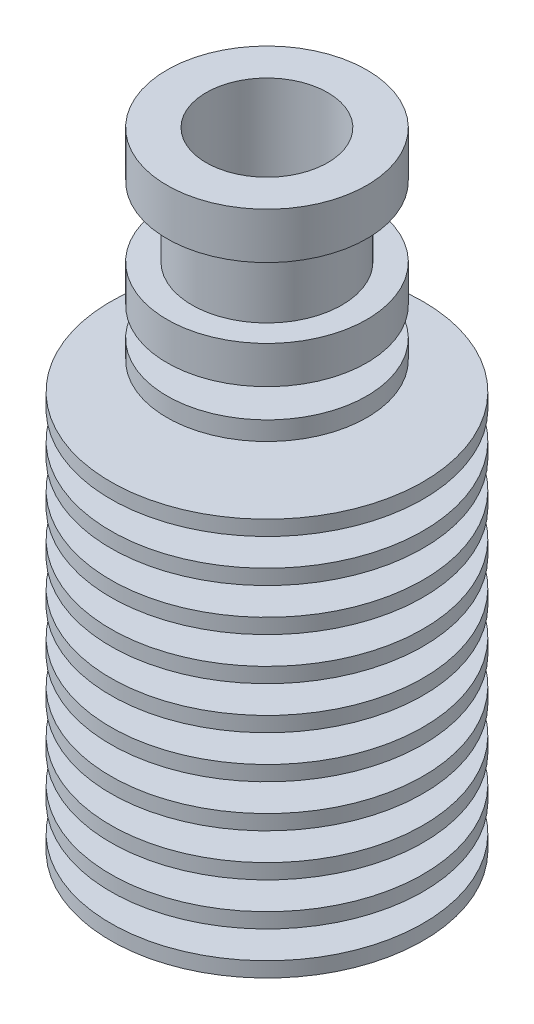
ISO-10303-21;
HEADER;
FILE_DESCRIPTION(('STEP AP214'),'2;1');
FILE_NAME('part.step','',(''),(''),'','','');
FILE_SCHEMA(('AUTOMOTIVE_DESIGN { 1 0 10303 214 1 1 1 1 }'));
ENDSEC;
DATA;
#1=APPLICATION_CONTEXT('core data for automotive mechanical design processes');
#2=APPLICATION_PROTOCOL_DEFINITION('international standard','automotive_design',2000,#1);
#3=PRODUCT_CONTEXT('',#1,'mechanical');
#4=PRODUCT('Part','Part','',(#3));
#5=PRODUCT_RELATED_PRODUCT_CATEGORY('part','',(#4));
#6=PRODUCT_DEFINITION_FORMATION('','',#4);
#7=PRODUCT_DEFINITION_CONTEXT('part definition',#1,'design');
#8=PRODUCT_DEFINITION('design','',#6,#7);
#9=PRODUCT_DEFINITION_SHAPE('','',#8);
#10=(LENGTH_UNIT() NAMED_UNIT(*) SI_UNIT(.MILLI.,.METRE.));
#11=(NAMED_UNIT(*) PLANE_ANGLE_UNIT() SI_UNIT($,.RADIAN.));
#12=(NAMED_UNIT(*) SI_UNIT($,.STERADIAN.) SOLID_ANGLE_UNIT());
#13=UNCERTAINTY_MEASURE_WITH_UNIT(LENGTH_MEASURE(1.E-05),#10,'distance_accuracy_value','');
#14=(GEOMETRIC_REPRESENTATION_CONTEXT(3) GLOBAL_UNCERTAINTY_ASSIGNED_CONTEXT((#13)) GLOBAL_UNIT_ASSIGNED_CONTEXT((#10,
#11,#12)) REPRESENTATION_CONTEXT('',''));
#15=CARTESIAN_POINT('',(0.,0.,0.));
#16=DIRECTION('',(0.,0.,1.));
#17=DIRECTION('',(1.,0.,0.));
#18=AXIS2_PLACEMENT_3D('',#15,#16,#17);
#19=CARTESIAN_POINT('',(0.,-25.05,0.));
#20=DIRECTION('',(0.,-1.,0.));
#21=DIRECTION('',(0.,0.,-1.));
#22=AXIS2_PLACEMENT_3D('',#19,#20,#21);
#23=CYLINDRICAL_SURFACE('',#22,3.);
#24=CARTESIAN_POINT('',(0.,-25.05,0.));
#25=DIRECTION('',(0.,-1.,0.));
#26=DIRECTION('',(0.,0.,-1.));
#27=AXIS2_PLACEMENT_3D('',#24,#25,#26);
#28=CIRCLE('',#27,3.);
#29=CARTESIAN_POINT('',(0.,-25.05,-3.));
#30=VERTEX_POINT('',#29);
#31=EDGE_CURVE('E209',#30,#30,#28,.T.);
#32=ORIENTED_EDGE('',*,*,#31,.T.);
#33=EDGE_LOOP('',(#32));
#34=FACE_BOUND('',#33,.T.);
#35=CARTESIAN_POINT('',(0.,-7.05,0.));
#36=DIRECTION('',(0.,-1.,0.));
#37=DIRECTION('',(0.,0.,-1.));
#38=AXIS2_PLACEMENT_3D('',#35,#36,#37);
#39=CIRCLE('',#38,3.);
#40=CARTESIAN_POINT('',(0.,-7.05,-3.));
#41=VERTEX_POINT('',#40);
#42=EDGE_CURVE('E10',#41,#41,#39,.T.);
#43=ORIENTED_EDGE('',*,*,#42,.F.);
#44=EDGE_LOOP('',(#43));
#45=FACE_BOUND('',#44,.T.);
#46=ADVANCED_FACE('F31',(#34,#45),#23,.F.);
#47=CARTESIAN_POINT('',(0.,-5.89529946162076,0.));
#48=DIRECTION('',(0.,-1.,0.));
#49=DIRECTION('',(0.,0.,-1.));
#50=AXIS2_PLACEMENT_3D('',#47,#48,#49);
#51=CONICAL_SURFACE('',#50,1.,1.0471975511966);
#52=ORIENTED_EDGE('',*,*,#42,.T.);
#53=EDGE_LOOP('',(#52));
#54=FACE_BOUND('',#53,.T.);
#55=CARTESIAN_POINT('',(0.,-5.89529946162076,0.));
#56=DIRECTION('',(0.,-1.,0.));
#57=DIRECTION('',(0.,0.,-1.));
#58=AXIS2_PLACEMENT_3D('',#55,#56,#57);
#59=CIRCLE('',#58,1.);
#60=CARTESIAN_POINT('',(0.,-5.89529946162076,-1.));
#61=VERTEX_POINT('',#60);
#62=EDGE_CURVE('E37',#61,#61,#59,.T.);
#63=ORIENTED_EDGE('',*,*,#62,.F.);
#64=EDGE_LOOP('',(#63));
#65=FACE_BOUND('',#64,.T.);
#66=ADVANCED_FACE('F227',(#54,#65),#51,.F.);
#67=CARTESIAN_POINT('',(0.,-25.05,0.));
#68=DIRECTION('',(0.,-1.,0.));
#69=DIRECTION('',(0.,0.,-1.));
#70=AXIS2_PLACEMENT_3D('',#67,#68,#69);
#71=CYLINDRICAL_SURFACE('',#70,1.);
#72=ORIENTED_EDGE('',*,*,#62,.T.);
#73=EDGE_LOOP('',(#72));
#74=FACE_BOUND('',#73,.T.);
#75=CARTESIAN_POINT('',(0.,5.51188301285237,0.));
#76=DIRECTION('',(0.,-1.,0.));
#77=DIRECTION('',(0.,0.,-1.));
#78=AXIS2_PLACEMENT_3D('',#75,#76,#77);
#79=CIRCLE('',#78,1.);
#80=CARTESIAN_POINT('',(0.,5.51188301285237,-1.));
#81=VERTEX_POINT('',#80);
#82=EDGE_CURVE('E41',#81,#81,#79,.T.);
#83=ORIENTED_EDGE('',*,*,#82,.F.);
#84=EDGE_LOOP('',(#83));
#85=FACE_BOUND('',#84,.T.);
#86=ADVANCED_FACE('F231',(#74,#85),#71,.F.);
#87=CARTESIAN_POINT('',(0.,6.08923328204199,0.));
#88=DIRECTION('',(0.,1.,0.));
#89=DIRECTION('',(0.,0.,1.));
#90=AXIS2_PLACEMENT_3D('',#87,#88,#89);
#91=CONICAL_SURFACE('',#90,2.,1.0471975511966);
#92=ORIENTED_EDGE('',*,*,#82,.T.);
#93=EDGE_LOOP('',(#92));
#94=FACE_BOUND('',#93,.T.);
#95=CARTESIAN_POINT('',(0.,6.08923328204199,0.));
#96=DIRECTION('',(0.,-1.,0.));
#97=DIRECTION('',(0.,0.,-1.));
#98=AXIS2_PLACEMENT_3D('',#95,#96,#97);
#99=CIRCLE('',#98,2.);
#100=CARTESIAN_POINT('',(0.,6.08923328204199,-2.));
#101=VERTEX_POINT('',#100);
#102=EDGE_CURVE('E45',#101,#101,#99,.T.);
#103=ORIENTED_EDGE('',*,*,#102,.F.);
#104=EDGE_LOOP('',(#103));
#105=FACE_BOUND('',#104,.T.);
#106=ADVANCED_FACE('F235',(#94,#105),#91,.F.);
#107=CARTESIAN_POINT('',(0.,-25.05,0.));
#108=DIRECTION('',(0.,-1.,0.));
#109=DIRECTION('',(0.,0.,-1.));
#110=AXIS2_PLACEMENT_3D('',#107,#108,#109);
#111=CYLINDRICAL_SURFACE('',#110,2.);
#112=ORIENTED_EDGE('',*,*,#102,.T.);
#113=EDGE_LOOP('',(#112));
#114=FACE_BOUND('',#113,.T.);
#115=CARTESIAN_POINT('',(0.,10.089233282042,0.));
#116=DIRECTION('',(0.,-1.,0.));
#117=DIRECTION('',(0.,0.,-1.));
#118=AXIS2_PLACEMENT_3D('',#115,#116,#117);
#119=CIRCLE('',#118,2.);
#120=CARTESIAN_POINT('',(0.,10.089233282042,-2.));
#121=VERTEX_POINT('',#120);
#122=EDGE_CURVE('E50',#121,#121,#119,.T.);
#123=ORIENTED_EDGE('',*,*,#122,.F.);
#124=EDGE_LOOP('',(#123));
#125=FACE_BOUND('',#124,.T.);
#126=ADVANCED_FACE('F241',(#114,#125),#111,.F.);
#127=CARTESIAN_POINT('',(0.,15.05,0.));
#128=DIRECTION('',(0.,1.,0.));
#129=DIRECTION('',(0.,0.,1.));
#130=AXIS2_PLACEMENT_3D('',#127,#128,#129);
#131=CONICAL_SURFACE('',#130,4.8641,0.5235987755983);
#132=ORIENTED_EDGE('',*,*,#122,.T.);
#133=EDGE_LOOP('',(#132));
#134=FACE_BOUND('',#133,.T.);
#135=CARTESIAN_POINT('',(0.,15.05,0.));
#136=DIRECTION('',(0.,-1.,0.));
#137=DIRECTION('',(0.,0.,-1.));
#138=AXIS2_PLACEMENT_3D('',#135,#136,#137);
#139=CIRCLE('',#138,4.8641);
#140=CARTESIAN_POINT('',(0.,15.05,-4.8641));
#141=VERTEX_POINT('',#140);
#142=EDGE_CURVE('E53',#141,#141,#139,.T.);
#143=ORIENTED_EDGE('',*,*,#142,.F.);
#144=EDGE_LOOP('',(#143));
#145=FACE_BOUND('',#144,.T.);
#146=ADVANCED_FACE('F245',(#134,#145),#131,.F.);
#147=CARTESIAN_POINT('',(0.,-25.05,0.));
#148=DIRECTION('',(0.,-1.,0.));
#149=DIRECTION('',(0.,0.,-1.));
#150=AXIS2_PLACEMENT_3D('',#147,#148,#149);
#151=CYLINDRICAL_SURFACE('',#150,4.8641);
#152=ORIENTED_EDGE('',*,*,#142,.T.);
#153=EDGE_LOOP('',(#152));
#154=FACE_BOUND('',#153,.T.);
#155=CARTESIAN_POINT('',(0.,25.05,0.));
#156=DIRECTION('',(0.,-1.,0.));
#157=DIRECTION('',(0.,0.,-1.));
#158=AXIS2_PLACEMENT_3D('',#155,#156,#157);
#159=CIRCLE('',#158,4.8641);
#160=CARTESIAN_POINT('',(0.,25.05,-4.8641));
#161=VERTEX_POINT('',#160);
#162=EDGE_CURVE('E56',#161,#161,#159,.T.);
#163=ORIENTED_EDGE('',*,*,#162,.F.);
#164=EDGE_LOOP('',(#163));
#165=FACE_BOUND('',#164,.T.);
#166=ADVANCED_FACE('F249',(#154,#165),#151,.F.);
#167=CARTESIAN_POINT('',(4.8641,25.05,0.));
#168=DIRECTION('',(0.,1.,0.));
#169=DIRECTION('',(0.,0.,1.));
#170=AXIS2_PLACEMENT_3D('',#167,#168,#169);
#171=PLANE('',#170);
#172=ORIENTED_EDGE('',*,*,#162,.T.);
#173=EDGE_LOOP('',(#172));
#174=FACE_BOUND('',#173,.T.);
#175=CARTESIAN_POINT('',(0.,25.05,0.));
#176=DIRECTION('',(0.,-1.,0.));
#177=DIRECTION('',(0.,0.,-1.));
#178=AXIS2_PLACEMENT_3D('',#175,#176,#177);
#179=CIRCLE('',#178,8.);
#180=CARTESIAN_POINT('',(0.,25.05,-8.));
#181=VERTEX_POINT('',#180);
#182=EDGE_CURVE('E59',#181,#181,#179,.T.);
#183=ORIENTED_EDGE('',*,*,#182,.F.);
#184=EDGE_LOOP('',(#183));
#185=FACE_BOUND('',#184,.T.);
#186=ADVANCED_FACE('F253',(#174,#185),#171,.T.);
#187=CARTESIAN_POINT('',(0.,-25.05,0.));
#188=DIRECTION('',(0.,-1.,0.));
#189=DIRECTION('',(0.,0.,-1.));
#190=AXIS2_PLACEMENT_3D('',#187,#188,#189);
#191=CYLINDRICAL_SURFACE('',#190,8.);
#192=ORIENTED_EDGE('',*,*,#182,.T.);
#193=EDGE_LOOP('',(#192));
#194=FACE_BOUND('',#193,.T.);
#195=CARTESIAN_POINT('',(0.,21.35,0.));
#196=DIRECTION('',(0.,-1.,0.));
#197=DIRECTION('',(0.,0.,-1.));
#198=AXIS2_PLACEMENT_3D('',#195,#196,#197);
#199=CIRCLE('',#198,8.);
#200=CARTESIAN_POINT('',(0.,21.35,-8.));
#201=VERTEX_POINT('',#200);
#202=EDGE_CURVE('E62',#201,#201,#199,.T.);
#203=ORIENTED_EDGE('',*,*,#202,.F.);
#204=EDGE_LOOP('',(#203));
#205=FACE_BOUND('',#204,.T.);
#206=ADVANCED_FACE('F257',(#194,#205),#191,.T.);
#207=CARTESIAN_POINT('',(6.,21.35,0.));
#208=DIRECTION('',(0.,-1.,0.));
#209=DIRECTION('',(0.,0.,-1.));
#210=AXIS2_PLACEMENT_3D('',#207,#208,#209);
#211=PLANE('',#210);
#212=ORIENTED_EDGE('',*,*,#202,.T.);
#213=EDGE_LOOP('',(#212));
#214=FACE_BOUND('',#213,.T.);
#215=CARTESIAN_POINT('',(0.,21.35,0.));
#216=DIRECTION('',(0.,-1.,0.));
#217=DIRECTION('',(0.,0.,-1.));
#218=AXIS2_PLACEMENT_3D('',#215,#216,#217);
#219=CIRCLE('',#218,6.);
#220=CARTESIAN_POINT('',(0.,21.35,-6.));
#221=VERTEX_POINT('',#220);
#222=EDGE_CURVE('E65',#221,#221,#219,.T.);
#223=ORIENTED_EDGE('',*,*,#222,.F.);
#224=EDGE_LOOP('',(#223));
#225=FACE_BOUND('',#224,.T.);
#226=ADVANCED_FACE('F261',(#214,#225),#211,.T.);
#227=CARTESIAN_POINT('',(0.,-25.05,0.));
#228=DIRECTION('',(0.,-1.,0.));
#229=DIRECTION('',(0.,0.,-1.));
#230=AXIS2_PLACEMENT_3D('',#227,#228,#229);
#231=CYLINDRICAL_SURFACE('',#230,6.);
#232=ORIENTED_EDGE('',*,*,#222,.T.);
#233=EDGE_LOOP('',(#232));
#234=FACE_BOUND('',#233,.T.);
#235=CARTESIAN_POINT('',(0.,15.75,0.));
#236=DIRECTION('',(0.,-1.,0.));
#237=DIRECTION('',(0.,0.,-1.));
#238=AXIS2_PLACEMENT_3D('',#235,#236,#237);
#239=CIRCLE('',#238,6.);
#240=CARTESIAN_POINT('',(0.,15.75,-6.));
#241=VERTEX_POINT('',#240);
#242=EDGE_CURVE('E68',#241,#241,#239,.T.);
#243=ORIENTED_EDGE('',*,*,#242,.F.);
#244=EDGE_LOOP('',(#243));
#245=FACE_BOUND('',#244,.T.);
#246=ADVANCED_FACE('F265',(#234,#245),#231,.T.);
#247=CARTESIAN_POINT('',(8.,15.75,0.));
#248=DIRECTION('',(0.,1.,0.));
#249=DIRECTION('',(0.,0.,1.));
#250=AXIS2_PLACEMENT_3D('',#247,#248,#249);
#251=PLANE('',#250);
#252=ORIENTED_EDGE('',*,*,#242,.T.);
#253=EDGE_LOOP('',(#252));
#254=FACE_BOUND('',#253,.T.);
#255=CARTESIAN_POINT('',(0.,15.75,0.));
#256=DIRECTION('',(0.,-1.,0.));
#257=DIRECTION('',(0.,0.,-1.));
#258=AXIS2_PLACEMENT_3D('',#255,#256,#257);
#259=CIRCLE('',#258,8.);
#260=CARTESIAN_POINT('',(0.,15.75,-8.));
#261=VERTEX_POINT('',#260);
#262=EDGE_CURVE('E71',#261,#261,#259,.T.);
#263=ORIENTED_EDGE('',*,*,#262,.F.);
#264=EDGE_LOOP('',(#263));
#265=FACE_BOUND('',#264,.T.);
#266=ADVANCED_FACE('F269',(#254,#265),#251,.T.);
#267=CARTESIAN_POINT('',(0.,-25.05,0.));
#268=DIRECTION('',(0.,-1.,0.));
#269=DIRECTION('',(0.,0.,-1.));
#270=AXIS2_PLACEMENT_3D('',#267,#268,#269);
#271=CYLINDRICAL_SURFACE('',#270,8.);
#272=ORIENTED_EDGE('',*,*,#262,.T.);
#273=EDGE_LOOP('',(#272));
#274=FACE_BOUND('',#273,.T.);
#275=CARTESIAN_POINT('',(0.,12.75,0.));
#276=DIRECTION('',(0.,-1.,0.));
#277=DIRECTION('',(0.,0.,-1.));
#278=AXIS2_PLACEMENT_3D('',#275,#276,#277);
#279=CIRCLE('',#278,8.);
#280=CARTESIAN_POINT('',(0.,12.75,-8.));
#281=VERTEX_POINT('',#280);
#282=EDGE_CURVE('E74',#281,#281,#279,.T.);
#283=ORIENTED_EDGE('',*,*,#282,.F.);
#284=EDGE_LOOP('',(#283));
#285=FACE_BOUND('',#284,.T.);
#286=ADVANCED_FACE('F273',(#274,#285),#271,.T.);
#287=CARTESIAN_POINT('',(4.5,12.75,0.));
#288=DIRECTION('',(0.,-1.,0.));
#289=DIRECTION('',(0.,0.,-1.));
#290=AXIS2_PLACEMENT_3D('',#287,#288,#289);
#291=PLANE('',#290);
#292=ORIENTED_EDGE('',*,*,#282,.T.);
#293=EDGE_LOOP('',(#292));
#294=FACE_BOUND('',#293,.T.);
#295=CARTESIAN_POINT('',(0.,12.75,0.));
#296=DIRECTION('',(0.,-1.,0.));
#297=DIRECTION('',(0.,0.,-1.));
#298=AXIS2_PLACEMENT_3D('',#295,#296,#297);
#299=CIRCLE('',#298,4.5);
#300=CARTESIAN_POINT('',(0.,12.75,-4.5));
#301=VERTEX_POINT('',#300);
#302=EDGE_CURVE('E77',#301,#301,#299,.T.);
#303=ORIENTED_EDGE('',*,*,#302,.F.);
#304=EDGE_LOOP('',(#303));
#305=FACE_BOUND('',#304,.T.);
#306=ADVANCED_FACE('F277',(#294,#305),#291,.T.);
#307=CARTESIAN_POINT('',(0.,-25.05,0.));
#308=DIRECTION('',(0.,-1.,0.));
#309=DIRECTION('',(0.,0.,-1.));
#310=AXIS2_PLACEMENT_3D('',#307,#308,#309);
#311=CYLINDRICAL_SURFACE('',#310,4.5);
#312=ORIENTED_EDGE('',*,*,#302,.T.);
#313=EDGE_LOOP('',(#312));
#314=FACE_BOUND('',#313,.T.);
#315=CARTESIAN_POINT('',(0.,10.45,0.));
#316=DIRECTION('',(0.,-1.,0.));
#317=DIRECTION('',(0.,0.,-1.));
#318=AXIS2_PLACEMENT_3D('',#315,#316,#317);
#319=CIRCLE('',#318,4.5);
#320=CARTESIAN_POINT('',(0.,10.45,-4.5));
#321=VERTEX_POINT('',#320);
#322=EDGE_CURVE('E80',#321,#321,#319,.T.);
#323=ORIENTED_EDGE('',*,*,#322,.F.);
#324=EDGE_LOOP('',(#323));
#325=FACE_BOUND('',#324,.T.);
#326=ADVANCED_FACE('F281',(#314,#325),#311,.T.);
#327=CARTESIAN_POINT('',(8.,10.45,0.));
#328=DIRECTION('',(0.,1.,0.));
#329=DIRECTION('',(0.,0.,1.));
#330=AXIS2_PLACEMENT_3D('',#327,#328,#329);
#331=PLANE('',#330);
#332=ORIENTED_EDGE('',*,*,#322,.T.);
#333=EDGE_LOOP('',(#332));
#334=FACE_BOUND('',#333,.T.);
#335=CARTESIAN_POINT('',(0.,10.45,0.));
#336=DIRECTION('',(0.,-1.,0.));
#337=DIRECTION('',(0.,0.,-1.));
#338=AXIS2_PLACEMENT_3D('',#335,#336,#337);
#339=CIRCLE('',#338,8.);
#340=CARTESIAN_POINT('',(0.,10.45,-8.));
#341=VERTEX_POINT('',#340);
#342=EDGE_CURVE('E83',#341,#341,#339,.T.);
#343=ORIENTED_EDGE('',*,*,#342,.F.);
#344=EDGE_LOOP('',(#343));
#345=FACE_BOUND('',#344,.T.);
#346=ADVANCED_FACE('F285',(#334,#345),#331,.T.);
#347=CARTESIAN_POINT('',(0.,-25.05,0.));
#348=DIRECTION('',(0.,-1.,0.));
#349=DIRECTION('',(0.,0.,-1.));
#350=AXIS2_PLACEMENT_3D('',#347,#348,#349);
#351=CYLINDRICAL_SURFACE('',#350,8.);
#352=ORIENTED_EDGE('',*,*,#342,.T.);
#353=EDGE_LOOP('',(#352));
#354=FACE_BOUND('',#353,.T.);
#355=CARTESIAN_POINT('',(0.,8.95,0.));
#356=DIRECTION('',(0.,-1.,0.));
#357=DIRECTION('',(0.,0.,-1.));
#358=AXIS2_PLACEMENT_3D('',#355,#356,#357);
#359=CIRCLE('',#358,8.);
#360=CARTESIAN_POINT('',(0.,8.95,-8.));
#361=VERTEX_POINT('',#360);
#362=EDGE_CURVE('E86',#361,#361,#359,.T.);
#363=ORIENTED_EDGE('',*,*,#362,.F.);
#364=EDGE_LOOP('',(#363));
#365=FACE_BOUND('',#364,.T.);
#366=ADVANCED_FACE('F289',(#354,#365),#351,.T.);
#367=CARTESIAN_POINT('',(4.5,8.95,0.));
#368=DIRECTION('',(0.,-1.,0.));
#369=DIRECTION('',(0.,0.,-1.));
#370=AXIS2_PLACEMENT_3D('',#367,#368,#369);
#371=PLANE('',#370);
#372=ORIENTED_EDGE('',*,*,#362,.T.);
#373=EDGE_LOOP('',(#372));
#374=FACE_BOUND('',#373,.T.);
#375=CARTESIAN_POINT('',(0.,8.95,0.));
#376=DIRECTION('',(0.,-1.,0.));
#377=DIRECTION('',(0.,0.,-1.));
#378=AXIS2_PLACEMENT_3D('',#375,#376,#377);
#379=CIRCLE('',#378,4.5);
#380=CARTESIAN_POINT('',(0.,8.95,-4.5));
#381=VERTEX_POINT('',#380);
#382=EDGE_CURVE('E89',#381,#381,#379,.T.);
#383=ORIENTED_EDGE('',*,*,#382,.F.);
#384=EDGE_LOOP('',(#383));
#385=FACE_BOUND('',#384,.T.);
#386=ADVANCED_FACE('F293',(#374,#385),#371,.T.);
#387=CARTESIAN_POINT('',(0.,-25.05,0.));
#388=DIRECTION('',(0.,-1.,0.));
#389=DIRECTION('',(0.,0.,-1.));
#390=AXIS2_PLACEMENT_3D('',#387,#388,#389);
#391=CYLINDRICAL_SURFACE('',#390,4.5);
#392=ORIENTED_EDGE('',*,*,#382,.T.);
#393=EDGE_LOOP('',(#392));
#394=FACE_BOUND('',#393,.T.);
#395=CARTESIAN_POINT('',(0.,6.75,0.));
#396=DIRECTION('',(0.,-1.,0.));
#397=DIRECTION('',(0.,0.,-1.));
#398=AXIS2_PLACEMENT_3D('',#395,#396,#397);
#399=CIRCLE('',#398,4.5);
#400=CARTESIAN_POINT('',(0.,6.75,-4.5));
#401=VERTEX_POINT('',#400);
#402=EDGE_CURVE('E92',#401,#401,#399,.T.);
#403=ORIENTED_EDGE('',*,*,#402,.F.);
#404=EDGE_LOOP('',(#403));
#405=FACE_BOUND('',#404,.T.);
#406=ADVANCED_FACE('F297',(#394,#405),#391,.T.);
#407=CARTESIAN_POINT('',(12.5,6.75,0.));
#408=DIRECTION('',(0.,1.,0.));
#409=DIRECTION('',(0.,0.,1.));
#410=AXIS2_PLACEMENT_3D('',#407,#408,#409);
#411=PLANE('',#410);
#412=ORIENTED_EDGE('',*,*,#402,.T.);
#413=EDGE_LOOP('',(#412));
#414=FACE_BOUND('',#413,.T.);
#415=CARTESIAN_POINT('',(0.,6.75,0.));
#416=DIRECTION('',(0.,-1.,0.));
#417=DIRECTION('',(0.,0.,-1.));
#418=AXIS2_PLACEMENT_3D('',#415,#416,#417);
#419=CIRCLE('',#418,12.5);
#420=CARTESIAN_POINT('',(0.,6.75,-12.5));
#421=VERTEX_POINT('',#420);
#422=EDGE_CURVE('E95',#421,#421,#419,.T.);
#423=ORIENTED_EDGE('',*,*,#422,.F.);
#424=EDGE_LOOP('',(#423));
#425=FACE_BOUND('',#424,.T.);
#426=ADVANCED_FACE('F301',(#414,#425),#411,.T.);
#427=CARTESIAN_POINT('',(0.,-25.05,0.));
#428=DIRECTION('',(0.,-1.,0.));
#429=DIRECTION('',(0.,0.,-1.));
#430=AXIS2_PLACEMENT_3D('',#427,#428,#429);
#431=CYLINDRICAL_SURFACE('',#430,12.5);
#432=ORIENTED_EDGE('',*,*,#422,.T.);
#433=EDGE_LOOP('',(#432));
#434=FACE_BOUND('',#433,.T.);
#435=CARTESIAN_POINT('',(0.,5.55,0.));
#436=DIRECTION('',(0.,-1.,0.));
#437=DIRECTION('',(0.,0.,-1.));
#438=AXIS2_PLACEMENT_3D('',#435,#436,#437);
#439=CIRCLE('',#438,12.5);
#440=CARTESIAN_POINT('',(0.,5.55,-12.5));
#441=VERTEX_POINT('',#440);
#442=EDGE_CURVE('E98',#441,#441,#439,.T.);
#443=ORIENTED_EDGE('',*,*,#442,.F.);
#444=EDGE_LOOP('',(#443));
#445=FACE_BOUND('',#444,.T.);
#446=ADVANCED_FACE('F305',(#434,#445),#431,.T.);
#447=CARTESIAN_POINT('',(4.5,5.55,0.));
#448=DIRECTION('',(0.,-1.,0.));
#449=DIRECTION('',(0.,0.,-1.));
#450=AXIS2_PLACEMENT_3D('',#447,#448,#449);
#451=PLANE('',#450);
#452=ORIENTED_EDGE('',*,*,#442,.T.);
#453=EDGE_LOOP('',(#452));
#454=FACE_BOUND('',#453,.T.);
#455=CARTESIAN_POINT('',(0.,5.55,0.));
#456=DIRECTION('',(0.,-1.,0.));
#457=DIRECTION('',(0.,0.,-1.));
#458=AXIS2_PLACEMENT_3D('',#455,#456,#457);
#459=CIRCLE('',#458,4.5);
#460=CARTESIAN_POINT('',(0.,5.55,-4.5));
#461=VERTEX_POINT('',#460);
#462=EDGE_CURVE('E101',#461,#461,#459,.T.);
#463=ORIENTED_EDGE('',*,*,#462,.F.);
#464=EDGE_LOOP('',(#463));
#465=FACE_BOUND('',#464,.T.);
#466=ADVANCED_FACE('F309',(#454,#465),#451,.T.);
#467=CARTESIAN_POINT('',(0.,-25.05,0.));
#468=DIRECTION('',(0.,-1.,0.));
#469=DIRECTION('',(0.,0.,-1.));
#470=AXIS2_PLACEMENT_3D('',#467,#468,#469);
#471=CYLINDRICAL_SURFACE('',#470,4.5);
#472=ORIENTED_EDGE('',*,*,#462,.T.);
#473=EDGE_LOOP('',(#472));
#474=FACE_BOUND('',#473,.T.);
#475=CARTESIAN_POINT('',(0.,3.35,0.));
#476=DIRECTION('',(0.,-1.,0.));
#477=DIRECTION('',(0.,0.,-1.));
#478=AXIS2_PLACEMENT_3D('',#475,#476,#477);
#479=CIRCLE('',#478,4.5);
#480=CARTESIAN_POINT('',(0.,3.35,-4.5));
#481=VERTEX_POINT('',#480);
#482=EDGE_CURVE('E104',#481,#481,#479,.T.);
#483=ORIENTED_EDGE('',*,*,#482,.F.);
#484=EDGE_LOOP('',(#483));
#485=FACE_BOUND('',#484,.T.);
#486=ADVANCED_FACE('F313',(#474,#485),#471,.T.);
#487=CARTESIAN_POINT('',(12.5,3.35,0.));
#488=DIRECTION('',(0.,1.,0.));
#489=DIRECTION('',(0.,0.,1.));
#490=AXIS2_PLACEMENT_3D('',#487,#488,#489);
#491=PLANE('',#490);
#492=ORIENTED_EDGE('',*,*,#482,.T.);
#493=EDGE_LOOP('',(#492));
#494=FACE_BOUND('',#493,.T.);
#495=CARTESIAN_POINT('',(0.,3.35,0.));
#496=DIRECTION('',(0.,-1.,0.));
#497=DIRECTION('',(0.,0.,-1.));
#498=AXIS2_PLACEMENT_3D('',#495,#496,#497);
#499=CIRCLE('',#498,12.5);
#500=CARTESIAN_POINT('',(0.,3.35,-12.5));
#501=VERTEX_POINT('',#500);
#502=EDGE_CURVE('E107',#501,#501,#499,.T.);
#503=ORIENTED_EDGE('',*,*,#502,.F.);
#504=EDGE_LOOP('',(#503));
#505=FACE_BOUND('',#504,.T.);
#506=ADVANCED_FACE('F317',(#494,#505),#491,.T.);
#507=CARTESIAN_POINT('',(0.,-25.05,0.));
#508=DIRECTION('',(0.,-1.,0.));
#509=DIRECTION('',(0.,0.,-1.));
#510=AXIS2_PLACEMENT_3D('',#507,#508,#509);
#511=CYLINDRICAL_SURFACE('',#510,12.5);
#512=ORIENTED_EDGE('',*,*,#502,.T.);
#513=EDGE_LOOP('',(#512));
#514=FACE_BOUND('',#513,.T.);
#515=CARTESIAN_POINT('',(0.,2.15,0.));
#516=DIRECTION('',(0.,-1.,0.));
#517=DIRECTION('',(0.,0.,-1.));
#518=AXIS2_PLACEMENT_3D('',#515,#516,#517);
#519=CIRCLE('',#518,12.5);
#520=CARTESIAN_POINT('',(0.,2.15,-12.5));
#521=VERTEX_POINT('',#520);
#522=EDGE_CURVE('E110',#521,#521,#519,.T.);
#523=ORIENTED_EDGE('',*,*,#522,.F.);
#524=EDGE_LOOP('',(#523));
#525=FACE_BOUND('',#524,.T.);
#526=ADVANCED_FACE('F321',(#514,#525),#511,.T.);
#527=CARTESIAN_POINT('',(4.5,2.15,0.));
#528=DIRECTION('',(0.,-1.,0.));
#529=DIRECTION('',(0.,0.,-1.));
#530=AXIS2_PLACEMENT_3D('',#527,#528,#529);
#531=PLANE('',#530);
#532=ORIENTED_EDGE('',*,*,#522,.T.);
#533=EDGE_LOOP('',(#532));
#534=FACE_BOUND('',#533,.T.);
#535=CARTESIAN_POINT('',(0.,2.15,0.));
#536=DIRECTION('',(0.,-1.,0.));
#537=DIRECTION('',(0.,0.,-1.));
#538=AXIS2_PLACEMENT_3D('',#535,#536,#537);
#539=CIRCLE('',#538,4.5);
#540=CARTESIAN_POINT('',(0.,2.15,-4.5));
#541=VERTEX_POINT('',#540);
#542=EDGE_CURVE('E113',#541,#541,#539,.T.);
#543=ORIENTED_EDGE('',*,*,#542,.F.);
#544=EDGE_LOOP('',(#543));
#545=FACE_BOUND('',#544,.T.);
#546=ADVANCED_FACE('F325',(#534,#545),#531,.T.);
#547=CARTESIAN_POINT('',(0.,-25.05,0.));
#548=DIRECTION('',(0.,-1.,0.));
#549=DIRECTION('',(0.,0.,-1.));
#550=AXIS2_PLACEMENT_3D('',#547,#548,#549);
#551=CYLINDRICAL_SURFACE('',#550,4.5);
#552=ORIENTED_EDGE('',*,*,#542,.T.);
#553=EDGE_LOOP('',(#552));
#554=FACE_BOUND('',#553,.T.);
#555=CARTESIAN_POINT('',(0.,-0.0500000000000014,0.));
#556=DIRECTION('',(0.,-1.,0.));
#557=DIRECTION('',(0.,0.,-1.));
#558=AXIS2_PLACEMENT_3D('',#555,#556,#557);
#559=CIRCLE('',#558,4.5);
#560=CARTESIAN_POINT('',(0.,-0.0500000000000014,-4.5));
#561=VERTEX_POINT('',#560);
#562=EDGE_CURVE('E116',#561,#561,#559,.T.);
#563=ORIENTED_EDGE('',*,*,#562,.F.);
#564=EDGE_LOOP('',(#563));
#565=FACE_BOUND('',#564,.T.);
#566=ADVANCED_FACE('F329',(#554,#565),#551,.T.);
#567=CARTESIAN_POINT('',(12.5,-0.0500000000000002,0.));
#568=DIRECTION('',(0.,1.,0.));
#569=DIRECTION('',(0.,0.,1.));
#570=AXIS2_PLACEMENT_3D('',#567,#568,#569);
#571=PLANE('',#570);
#572=ORIENTED_EDGE('',*,*,#562,.T.);
#573=EDGE_LOOP('',(#572));
#574=FACE_BOUND('',#573,.T.);
#575=CARTESIAN_POINT('',(0.,-0.049999999999998,0.));
#576=DIRECTION('',(0.,-1.,0.));
#577=DIRECTION('',(0.,0.,-1.));
#578=AXIS2_PLACEMENT_3D('',#575,#576,#577);
#579=CIRCLE('',#578,12.5);
#580=CARTESIAN_POINT('',(0.,-0.049999999999998,-12.5));
#581=VERTEX_POINT('',#580);
#582=EDGE_CURVE('E119',#581,#581,#579,.T.);
#583=ORIENTED_EDGE('',*,*,#582,.F.);
#584=EDGE_LOOP('',(#583));
#585=FACE_BOUND('',#584,.T.);
#586=ADVANCED_FACE('F333',(#574,#585),#571,.T.);
#587=CARTESIAN_POINT('',(0.,-25.05,0.));
#588=DIRECTION('',(0.,-1.,0.));
#589=DIRECTION('',(0.,0.,-1.));
#590=AXIS2_PLACEMENT_3D('',#587,#588,#589);
#591=CYLINDRICAL_SURFACE('',#590,12.5);
#592=ORIENTED_EDGE('',*,*,#582,.T.);
#593=EDGE_LOOP('',(#592));
#594=FACE_BOUND('',#593,.T.);
#595=CARTESIAN_POINT('',(0.,-1.25,0.));
#596=DIRECTION('',(0.,-1.,0.));
#597=DIRECTION('',(0.,0.,-1.));
#598=AXIS2_PLACEMENT_3D('',#595,#596,#597);
#599=CIRCLE('',#598,12.5);
#600=CARTESIAN_POINT('',(0.,-1.25,-12.5));
#601=VERTEX_POINT('',#600);
#602=EDGE_CURVE('E122',#601,#601,#599,.T.);
#603=ORIENTED_EDGE('',*,*,#602,.F.);
#604=EDGE_LOOP('',(#603));
#605=FACE_BOUND('',#604,.T.);
#606=ADVANCED_FACE('F337',(#594,#605),#591,.T.);
#607=CARTESIAN_POINT('',(4.5,-1.25,0.));
#608=DIRECTION('',(0.,-1.,0.));
#609=DIRECTION('',(0.,0.,-1.));
#610=AXIS2_PLACEMENT_3D('',#607,#608,#609);
#611=PLANE('',#610);
#612=ORIENTED_EDGE('',*,*,#602,.T.);
#613=EDGE_LOOP('',(#612));
#614=FACE_BOUND('',#613,.T.);
#615=CARTESIAN_POINT('',(0.,-1.25,0.));
#616=DIRECTION('',(0.,-1.,0.));
#617=DIRECTION('',(0.,0.,-1.));
#618=AXIS2_PLACEMENT_3D('',#615,#616,#617);
#619=CIRCLE('',#618,4.5);
#620=CARTESIAN_POINT('',(0.,-1.25,-4.5));
#621=VERTEX_POINT('',#620);
#622=EDGE_CURVE('E125',#621,#621,#619,.T.);
#623=ORIENTED_EDGE('',*,*,#622,.F.);
#624=EDGE_LOOP('',(#623));
#625=FACE_BOUND('',#624,.T.);
#626=ADVANCED_FACE('F341',(#614,#625),#611,.T.);
#627=CARTESIAN_POINT('',(0.,-25.05,0.));
#628=DIRECTION('',(0.,-1.,0.));
#629=DIRECTION('',(0.,0.,-1.));
#630=AXIS2_PLACEMENT_3D('',#627,#628,#629);
#631=CYLINDRICAL_SURFACE('',#630,4.5);
#632=ORIENTED_EDGE('',*,*,#622,.T.);
#633=EDGE_LOOP('',(#632));
#634=FACE_BOUND('',#633,.T.);
#635=CARTESIAN_POINT('',(0.,-3.45,0.));
#636=DIRECTION('',(0.,-1.,0.));
#637=DIRECTION('',(0.,0.,-1.));
#638=AXIS2_PLACEMENT_3D('',#635,#636,#637);
#639=CIRCLE('',#638,4.5);
#640=CARTESIAN_POINT('',(0.,-3.45,-4.5));
#641=VERTEX_POINT('',#640);
#642=EDGE_CURVE('E128',#641,#641,#639,.T.);
#643=ORIENTED_EDGE('',*,*,#642,.F.);
#644=EDGE_LOOP('',(#643));
#645=FACE_BOUND('',#644,.T.);
#646=ADVANCED_FACE('F345',(#634,#645),#631,.T.);
#647=CARTESIAN_POINT('',(12.5,-3.45,0.));
#648=DIRECTION('',(0.,1.,0.));
#649=DIRECTION('',(0.,0.,1.));
#650=AXIS2_PLACEMENT_3D('',#647,#648,#649);
#651=PLANE('',#650);
#652=ORIENTED_EDGE('',*,*,#642,.T.);
#653=EDGE_LOOP('',(#652));
#654=FACE_BOUND('',#653,.T.);
#655=CARTESIAN_POINT('',(0.,-3.45,0.));
#656=DIRECTION('',(0.,-1.,0.));
#657=DIRECTION('',(0.,0.,-1.));
#658=AXIS2_PLACEMENT_3D('',#655,#656,#657);
#659=CIRCLE('',#658,12.5);
#660=CARTESIAN_POINT('',(0.,-3.45,-12.5));
#661=VERTEX_POINT('',#660);
#662=EDGE_CURVE('E131',#661,#661,#659,.T.);
#663=ORIENTED_EDGE('',*,*,#662,.F.);
#664=EDGE_LOOP('',(#663));
#665=FACE_BOUND('',#664,.T.);
#666=ADVANCED_FACE('F349',(#654,#665),#651,.T.);
#667=CARTESIAN_POINT('',(0.,-25.05,0.));
#668=DIRECTION('',(0.,-1.,0.));
#669=DIRECTION('',(0.,0.,-1.));
#670=AXIS2_PLACEMENT_3D('',#667,#668,#669);
#671=CYLINDRICAL_SURFACE('',#670,12.5);
#672=ORIENTED_EDGE('',*,*,#662,.T.);
#673=EDGE_LOOP('',(#672));
#674=FACE_BOUND('',#673,.T.);
#675=CARTESIAN_POINT('',(0.,-4.65,0.));
#676=DIRECTION('',(0.,-1.,0.));
#677=DIRECTION('',(0.,0.,-1.));
#678=AXIS2_PLACEMENT_3D('',#675,#676,#677);
#679=CIRCLE('',#678,12.5);
#680=CARTESIAN_POINT('',(0.,-4.65,-12.5));
#681=VERTEX_POINT('',#680);
#682=EDGE_CURVE('E134',#681,#681,#679,.T.);
#683=ORIENTED_EDGE('',*,*,#682,.F.);
#684=EDGE_LOOP('',(#683));
#685=FACE_BOUND('',#684,.T.);
#686=ADVANCED_FACE('F353',(#674,#685),#671,.T.);
#687=CARTESIAN_POINT('',(6.5,-4.65,0.));
#688=DIRECTION('',(0.,-1.,0.));
#689=DIRECTION('',(0.,0.,-1.));
#690=AXIS2_PLACEMENT_3D('',#687,#688,#689);
#691=PLANE('',#690);
#692=ORIENTED_EDGE('',*,*,#682,.T.);
#693=EDGE_LOOP('',(#692));
#694=FACE_BOUND('',#693,.T.);
#695=CARTESIAN_POINT('',(0.,-4.65,0.));
#696=DIRECTION('',(0.,-1.,0.));
#697=DIRECTION('',(0.,0.,-1.));
#698=AXIS2_PLACEMENT_3D('',#695,#696,#697);
#699=CIRCLE('',#698,6.5);
#700=CARTESIAN_POINT('',(0.,-4.65,-6.5));
#701=VERTEX_POINT('',#700);
#702=EDGE_CURVE('E137',#701,#701,#699,.T.);
#703=ORIENTED_EDGE('',*,*,#702,.F.);
#704=EDGE_LOOP('',(#703));
#705=FACE_BOUND('',#704,.T.);
#706=ADVANCED_FACE('F357',(#694,#705),#691,.T.);
#707=CARTESIAN_POINT('',(0.,-25.05,0.));
#708=DIRECTION('',(0.,-1.,0.));
#709=DIRECTION('',(0.,0.,-1.));
#710=AXIS2_PLACEMENT_3D('',#707,#708,#709);
#711=CYLINDRICAL_SURFACE('',#710,6.5);
#712=ORIENTED_EDGE('',*,*,#702,.T.);
#713=EDGE_LOOP('',(#712));
#714=FACE_BOUND('',#713,.T.);
#715=CARTESIAN_POINT('',(0.,-6.85,0.));
#716=DIRECTION('',(0.,-1.,0.));
#717=DIRECTION('',(0.,0.,-1.));
#718=AXIS2_PLACEMENT_3D('',#715,#716,#717);
#719=CIRCLE('',#718,6.5);
#720=CARTESIAN_POINT('',(0.,-6.85,-6.5));
#721=VERTEX_POINT('',#720);
#722=EDGE_CURVE('E140',#721,#721,#719,.T.);
#723=ORIENTED_EDGE('',*,*,#722,.F.);
#724=EDGE_LOOP('',(#723));
#725=FACE_BOUND('',#724,.T.);
#726=ADVANCED_FACE('F361',(#714,#725),#711,.T.);
#727=CARTESIAN_POINT('',(12.5,-6.85,0.));
#728=DIRECTION('',(0.,1.,0.));
#729=DIRECTION('',(0.,0.,1.));
#730=AXIS2_PLACEMENT_3D('',#727,#728,#729);
#731=PLANE('',#730);
#732=ORIENTED_EDGE('',*,*,#722,.T.);
#733=EDGE_LOOP('',(#732));
#734=FACE_BOUND('',#733,.T.);
#735=CARTESIAN_POINT('',(0.,-6.85,0.));
#736=DIRECTION('',(0.,-1.,0.));
#737=DIRECTION('',(0.,0.,-1.));
#738=AXIS2_PLACEMENT_3D('',#735,#736,#737);
#739=CIRCLE('',#738,12.5);
#740=CARTESIAN_POINT('',(0.,-6.85,-12.5));
#741=VERTEX_POINT('',#740);
#742=EDGE_CURVE('E143',#741,#741,#739,.T.);
#743=ORIENTED_EDGE('',*,*,#742,.F.);
#744=EDGE_LOOP('',(#743));
#745=FACE_BOUND('',#744,.T.);
#746=ADVANCED_FACE('F365',(#734,#745),#731,.T.);
#747=CARTESIAN_POINT('',(0.,-25.05,0.));
#748=DIRECTION('',(0.,-1.,0.));
#749=DIRECTION('',(0.,0.,-1.));
#750=AXIS2_PLACEMENT_3D('',#747,#748,#749);
#751=CYLINDRICAL_SURFACE('',#750,12.5);
#752=ORIENTED_EDGE('',*,*,#742,.T.);
#753=EDGE_LOOP('',(#752));
#754=FACE_BOUND('',#753,.T.);
#755=CARTESIAN_POINT('',(0.,-8.05,0.));
#756=DIRECTION('',(0.,-1.,0.));
#757=DIRECTION('',(0.,0.,-1.));
#758=AXIS2_PLACEMENT_3D('',#755,#756,#757);
#759=CIRCLE('',#758,12.5);
#760=CARTESIAN_POINT('',(0.,-8.05,-12.5));
#761=VERTEX_POINT('',#760);
#762=EDGE_CURVE('E146',#761,#761,#759,.T.);
#763=ORIENTED_EDGE('',*,*,#762,.F.);
#764=EDGE_LOOP('',(#763));
#765=FACE_BOUND('',#764,.T.);
#766=ADVANCED_FACE('F369',(#754,#765),#751,.T.);
#767=CARTESIAN_POINT('',(7.5,-8.05,0.));
#768=DIRECTION('',(0.,-1.,0.));
#769=DIRECTION('',(0.,0.,-1.));
#770=AXIS2_PLACEMENT_3D('',#767,#768,#769);
#771=PLANE('',#770);
#772=ORIENTED_EDGE('',*,*,#762,.T.);
#773=EDGE_LOOP('',(#772));
#774=FACE_BOUND('',#773,.T.);
#775=CARTESIAN_POINT('',(0.,-8.05,0.));
#776=DIRECTION('',(0.,-1.,0.));
#777=DIRECTION('',(0.,0.,-1.));
#778=AXIS2_PLACEMENT_3D('',#775,#776,#777);
#779=CIRCLE('',#778,7.5);
#780=CARTESIAN_POINT('',(0.,-8.05,-7.5));
#781=VERTEX_POINT('',#780);
#782=EDGE_CURVE('E149',#781,#781,#779,.T.);
#783=ORIENTED_EDGE('',*,*,#782,.F.);
#784=EDGE_LOOP('',(#783));
#785=FACE_BOUND('',#784,.T.);
#786=ADVANCED_FACE('F373',(#774,#785),#771,.T.);
#787=CARTESIAN_POINT('',(0.,-25.05,0.));
#788=DIRECTION('',(0.,-1.,0.));
#789=DIRECTION('',(0.,0.,-1.));
#790=AXIS2_PLACEMENT_3D('',#787,#788,#789);
#791=CYLINDRICAL_SURFACE('',#790,7.5);
#792=ORIENTED_EDGE('',*,*,#782,.T.);
#793=EDGE_LOOP('',(#792));
#794=FACE_BOUND('',#793,.T.);
#795=CARTESIAN_POINT('',(0.,-10.25,0.));
#796=DIRECTION('',(0.,-1.,0.));
#797=DIRECTION('',(0.,0.,-1.));
#798=AXIS2_PLACEMENT_3D('',#795,#796,#797);
#799=CIRCLE('',#798,7.5);
#800=CARTESIAN_POINT('',(0.,-10.25,-7.5));
#801=VERTEX_POINT('',#800);
#802=EDGE_CURVE('E152',#801,#801,#799,.T.);
#803=ORIENTED_EDGE('',*,*,#802,.F.);
#804=EDGE_LOOP('',(#803));
#805=FACE_BOUND('',#804,.T.);
#806=ADVANCED_FACE('F377',(#794,#805),#791,.T.);
#807=CARTESIAN_POINT('',(12.5,-10.25,0.));
#808=DIRECTION('',(0.,1.,0.));
#809=DIRECTION('',(0.,0.,1.));
#810=AXIS2_PLACEMENT_3D('',#807,#808,#809);
#811=PLANE('',#810);
#812=ORIENTED_EDGE('',*,*,#802,.T.);
#813=EDGE_LOOP('',(#812));
#814=FACE_BOUND('',#813,.T.);
#815=CARTESIAN_POINT('',(0.,-10.25,0.));
#816=DIRECTION('',(0.,-1.,0.));
#817=DIRECTION('',(0.,0.,-1.));
#818=AXIS2_PLACEMENT_3D('',#815,#816,#817);
#819=CIRCLE('',#818,12.5);
#820=CARTESIAN_POINT('',(0.,-10.25,-12.5));
#821=VERTEX_POINT('',#820);
#822=EDGE_CURVE('E155',#821,#821,#819,.T.);
#823=ORIENTED_EDGE('',*,*,#822,.F.);
#824=EDGE_LOOP('',(#823));
#825=FACE_BOUND('',#824,.T.);
#826=ADVANCED_FACE('F381',(#814,#825),#811,.T.);
#827=CARTESIAN_POINT('',(0.,-25.05,0.));
#828=DIRECTION('',(0.,-1.,0.));
#829=DIRECTION('',(0.,0.,-1.));
#830=AXIS2_PLACEMENT_3D('',#827,#828,#829);
#831=CYLINDRICAL_SURFACE('',#830,12.5);
#832=ORIENTED_EDGE('',*,*,#822,.T.);
#833=EDGE_LOOP('',(#832));
#834=FACE_BOUND('',#833,.T.);
#835=CARTESIAN_POINT('',(0.,-11.45,0.));
#836=DIRECTION('',(0.,-1.,0.));
#837=DIRECTION('',(0.,0.,-1.));
#838=AXIS2_PLACEMENT_3D('',#835,#836,#837);
#839=CIRCLE('',#838,12.5);
#840=CARTESIAN_POINT('',(0.,-11.45,-12.5));
#841=VERTEX_POINT('',#840);
#842=EDGE_CURVE('E158',#841,#841,#839,.T.);
#843=ORIENTED_EDGE('',*,*,#842,.F.);
#844=EDGE_LOOP('',(#843));
#845=FACE_BOUND('',#844,.T.);
#846=ADVANCED_FACE('F385',(#834,#845),#831,.T.);
#847=CARTESIAN_POINT('',(7.5,-11.45,0.));
#848=DIRECTION('',(0.,-1.,0.));
#849=DIRECTION('',(0.,0.,-1.));
#850=AXIS2_PLACEMENT_3D('',#847,#848,#849);
#851=PLANE('',#850);
#852=ORIENTED_EDGE('',*,*,#842,.T.);
#853=EDGE_LOOP('',(#852));
#854=FACE_BOUND('',#853,.T.);
#855=CARTESIAN_POINT('',(0.,-11.45,0.));
#856=DIRECTION('',(0.,-1.,0.));
#857=DIRECTION('',(0.,0.,-1.));
#858=AXIS2_PLACEMENT_3D('',#855,#856,#857);
#859=CIRCLE('',#858,7.5);
#860=CARTESIAN_POINT('',(0.,-11.45,-7.5));
#861=VERTEX_POINT('',#860);
#862=EDGE_CURVE('E161',#861,#861,#859,.T.);
#863=ORIENTED_EDGE('',*,*,#862,.F.);
#864=EDGE_LOOP('',(#863));
#865=FACE_BOUND('',#864,.T.);
#866=ADVANCED_FACE('F389',(#854,#865),#851,.T.);
#867=CARTESIAN_POINT('',(0.,-25.05,0.));
#868=DIRECTION('',(0.,-1.,0.));
#869=DIRECTION('',(0.,0.,-1.));
#870=AXIS2_PLACEMENT_3D('',#867,#868,#869);
#871=CYLINDRICAL_SURFACE('',#870,7.5);
#872=ORIENTED_EDGE('',*,*,#862,.T.);
#873=EDGE_LOOP('',(#872));
#874=FACE_BOUND('',#873,.T.);
#875=CARTESIAN_POINT('',(0.,-13.65,0.));
#876=DIRECTION('',(0.,-1.,0.));
#877=DIRECTION('',(0.,0.,-1.));
#878=AXIS2_PLACEMENT_3D('',#875,#876,#877);
#879=CIRCLE('',#878,7.5);
#880=CARTESIAN_POINT('',(0.,-13.65,-7.5));
#881=VERTEX_POINT('',#880);
#882=EDGE_CURVE('E164',#881,#881,#879,.T.);
#883=ORIENTED_EDGE('',*,*,#882,.F.);
#884=EDGE_LOOP('',(#883));
#885=FACE_BOUND('',#884,.T.);
#886=ADVANCED_FACE('F393',(#874,#885),#871,.T.);
#887=CARTESIAN_POINT('',(12.5,-13.65,0.));
#888=DIRECTION('',(0.,1.,0.));
#889=DIRECTION('',(0.,0.,1.));
#890=AXIS2_PLACEMENT_3D('',#887,#888,#889);
#891=PLANE('',#890);
#892=ORIENTED_EDGE('',*,*,#882,.T.);
#893=EDGE_LOOP('',(#892));
#894=FACE_BOUND('',#893,.T.);
#895=CARTESIAN_POINT('',(0.,-13.65,0.));
#896=DIRECTION('',(0.,-1.,0.));
#897=DIRECTION('',(0.,0.,-1.));
#898=AXIS2_PLACEMENT_3D('',#895,#896,#897);
#899=CIRCLE('',#898,12.5);
#900=CARTESIAN_POINT('',(0.,-13.65,-12.5));
#901=VERTEX_POINT('',#900);
#902=EDGE_CURVE('E167',#901,#901,#899,.T.);
#903=ORIENTED_EDGE('',*,*,#902,.F.);
#904=EDGE_LOOP('',(#903));
#905=FACE_BOUND('',#904,.T.);
#906=ADVANCED_FACE('F397',(#894,#905),#891,.T.);
#907=CARTESIAN_POINT('',(0.,-25.05,0.));
#908=DIRECTION('',(0.,-1.,0.));
#909=DIRECTION('',(0.,0.,-1.));
#910=AXIS2_PLACEMENT_3D('',#907,#908,#909);
#911=CYLINDRICAL_SURFACE('',#910,12.5);
#912=ORIENTED_EDGE('',*,*,#902,.T.);
#913=EDGE_LOOP('',(#912));
#914=FACE_BOUND('',#913,.T.);
#915=CARTESIAN_POINT('',(0.,-14.85,0.));
#916=DIRECTION('',(0.,-1.,0.));
#917=DIRECTION('',(0.,0.,-1.));
#918=AXIS2_PLACEMENT_3D('',#915,#916,#917);
#919=CIRCLE('',#918,12.5);
#920=CARTESIAN_POINT('',(0.,-14.85,-12.5));
#921=VERTEX_POINT('',#920);
#922=EDGE_CURVE('E170',#921,#921,#919,.T.);
#923=ORIENTED_EDGE('',*,*,#922,.F.);
#924=EDGE_LOOP('',(#923));
#925=FACE_BOUND('',#924,.T.);
#926=ADVANCED_FACE('F401',(#914,#925),#911,.T.);
#927=CARTESIAN_POINT('',(7.5,-14.85,0.));
#928=DIRECTION('',(0.,-1.,0.));
#929=DIRECTION('',(0.,0.,-1.));
#930=AXIS2_PLACEMENT_3D('',#927,#928,#929);
#931=PLANE('',#930);
#932=ORIENTED_EDGE('',*,*,#922,.T.);
#933=EDGE_LOOP('',(#932));
#934=FACE_BOUND('',#933,.T.);
#935=CARTESIAN_POINT('',(0.,-14.85,0.));
#936=DIRECTION('',(0.,-1.,0.));
#937=DIRECTION('',(0.,0.,-1.));
#938=AXIS2_PLACEMENT_3D('',#935,#936,#937);
#939=CIRCLE('',#938,7.5);
#940=CARTESIAN_POINT('',(0.,-14.85,-7.5));
#941=VERTEX_POINT('',#940);
#942=EDGE_CURVE('E173',#941,#941,#939,.T.);
#943=ORIENTED_EDGE('',*,*,#942,.F.);
#944=EDGE_LOOP('',(#943));
#945=FACE_BOUND('',#944,.T.);
#946=ADVANCED_FACE('F405',(#934,#945),#931,.T.);
#947=CARTESIAN_POINT('',(0.,-25.05,0.));
#948=DIRECTION('',(0.,-1.,0.));
#949=DIRECTION('',(0.,0.,-1.));
#950=AXIS2_PLACEMENT_3D('',#947,#948,#949);
#951=CYLINDRICAL_SURFACE('',#950,7.5);
#952=ORIENTED_EDGE('',*,*,#942,.T.);
#953=EDGE_LOOP('',(#952));
#954=FACE_BOUND('',#953,.T.);
#955=CARTESIAN_POINT('',(0.,-17.05,0.));
#956=DIRECTION('',(0.,-1.,0.));
#957=DIRECTION('',(0.,0.,-1.));
#958=AXIS2_PLACEMENT_3D('',#955,#956,#957);
#959=CIRCLE('',#958,7.5);
#960=CARTESIAN_POINT('',(0.,-17.05,-7.5));
#961=VERTEX_POINT('',#960);
#962=EDGE_CURVE('E176',#961,#961,#959,.T.);
#963=ORIENTED_EDGE('',*,*,#962,.F.);
#964=EDGE_LOOP('',(#963));
#965=FACE_BOUND('',#964,.T.);
#966=ADVANCED_FACE('F409',(#954,#965),#951,.T.);
#967=CARTESIAN_POINT('',(12.5,-17.05,0.));
#968=DIRECTION('',(0.,1.,0.));
#969=DIRECTION('',(0.,0.,1.));
#970=AXIS2_PLACEMENT_3D('',#967,#968,#969);
#971=PLANE('',#970);
#972=ORIENTED_EDGE('',*,*,#962,.T.);
#973=EDGE_LOOP('',(#972));
#974=FACE_BOUND('',#973,.T.);
#975=CARTESIAN_POINT('',(0.,-17.05,0.));
#976=DIRECTION('',(0.,-1.,0.));
#977=DIRECTION('',(0.,0.,-1.));
#978=AXIS2_PLACEMENT_3D('',#975,#976,#977);
#979=CIRCLE('',#978,12.5);
#980=CARTESIAN_POINT('',(0.,-17.05,-12.5));
#981=VERTEX_POINT('',#980);
#982=EDGE_CURVE('E179',#981,#981,#979,.T.);
#983=ORIENTED_EDGE('',*,*,#982,.F.);
#984=EDGE_LOOP('',(#983));
#985=FACE_BOUND('',#984,.T.);
#986=ADVANCED_FACE('F413',(#974,#985),#971,.T.);
#987=CARTESIAN_POINT('',(0.,-25.05,0.));
#988=DIRECTION('',(0.,-1.,0.));
#989=DIRECTION('',(0.,0.,-1.));
#990=AXIS2_PLACEMENT_3D('',#987,#988,#989);
#991=CYLINDRICAL_SURFACE('',#990,12.5);
#992=ORIENTED_EDGE('',*,*,#982,.T.);
#993=EDGE_LOOP('',(#992));
#994=FACE_BOUND('',#993,.T.);
#995=CARTESIAN_POINT('',(0.,-18.25,0.));
#996=DIRECTION('',(0.,-1.,0.));
#997=DIRECTION('',(0.,0.,-1.));
#998=AXIS2_PLACEMENT_3D('',#995,#996,#997);
#999=CIRCLE('',#998,12.5);
#1000=CARTESIAN_POINT('',(0.,-18.25,-12.5));
#1001=VERTEX_POINT('',#1000);
#1002=EDGE_CURVE('E182',#1001,#1001,#999,.T.);
#1003=ORIENTED_EDGE('',*,*,#1002,.F.);
#1004=EDGE_LOOP('',(#1003));
#1005=FACE_BOUND('',#1004,.T.);
#1006=ADVANCED_FACE('F417',(#994,#1005),#991,.T.);
#1007=CARTESIAN_POINT('',(7.5,-18.25,0.));
#1008=DIRECTION('',(0.,-1.,0.));
#1009=DIRECTION('',(0.,0.,-1.));
#1010=AXIS2_PLACEMENT_3D('',#1007,#1008,#1009);
#1011=PLANE('',#1010);
#1012=ORIENTED_EDGE('',*,*,#1002,.T.);
#1013=EDGE_LOOP('',(#1012));
#1014=FACE_BOUND('',#1013,.T.);
#1015=CARTESIAN_POINT('',(0.,-18.25,0.));
#1016=DIRECTION('',(0.,-1.,0.));
#1017=DIRECTION('',(0.,0.,-1.));
#1018=AXIS2_PLACEMENT_3D('',#1015,#1016,#1017);
#1019=CIRCLE('',#1018,7.5);
#1020=CARTESIAN_POINT('',(0.,-18.25,-7.5));
#1021=VERTEX_POINT('',#1020);
#1022=EDGE_CURVE('E185',#1021,#1021,#1019,.T.);
#1023=ORIENTED_EDGE('',*,*,#1022,.F.);
#1024=EDGE_LOOP('',(#1023));
#1025=FACE_BOUND('',#1024,.T.);
#1026=ADVANCED_FACE('F421',(#1014,#1025),#1011,.T.);
#1027=CARTESIAN_POINT('',(0.,-25.05,0.));
#1028=DIRECTION('',(0.,-1.,0.));
#1029=DIRECTION('',(0.,0.,-1.));
#1030=AXIS2_PLACEMENT_3D('',#1027,#1028,#1029);
#1031=CYLINDRICAL_SURFACE('',#1030,7.5);
#1032=ORIENTED_EDGE('',*,*,#1022,.T.);
#1033=EDGE_LOOP('',(#1032));
#1034=FACE_BOUND('',#1033,.T.);
#1035=CARTESIAN_POINT('',(0.,-20.45,0.));
#1036=DIRECTION('',(0.,-1.,0.));
#1037=DIRECTION('',(0.,0.,-1.));
#1038=AXIS2_PLACEMENT_3D('',#1035,#1036,#1037);
#1039=CIRCLE('',#1038,7.5);
#1040=CARTESIAN_POINT('',(0.,-20.45,-7.5));
#1041=VERTEX_POINT('',#1040);
#1042=EDGE_CURVE('E188',#1041,#1041,#1039,.T.);
#1043=ORIENTED_EDGE('',*,*,#1042,.F.);
#1044=EDGE_LOOP('',(#1043));
#1045=FACE_BOUND('',#1044,.T.);
#1046=ADVANCED_FACE('F425',(#1034,#1045),#1031,.T.);
#1047=CARTESIAN_POINT('',(12.5,-20.45,0.));
#1048=DIRECTION('',(0.,1.,0.));
#1049=DIRECTION('',(0.,0.,1.));
#1050=AXIS2_PLACEMENT_3D('',#1047,#1048,#1049);
#1051=PLANE('',#1050);
#1052=ORIENTED_EDGE('',*,*,#1042,.T.);
#1053=EDGE_LOOP('',(#1052));
#1054=FACE_BOUND('',#1053,.T.);
#1055=CARTESIAN_POINT('',(0.,-20.45,0.));
#1056=DIRECTION('',(0.,-1.,0.));
#1057=DIRECTION('',(0.,0.,-1.));
#1058=AXIS2_PLACEMENT_3D('',#1055,#1056,#1057);
#1059=CIRCLE('',#1058,12.5);
#1060=CARTESIAN_POINT('',(0.,-20.45,-12.5));
#1061=VERTEX_POINT('',#1060);
#1062=EDGE_CURVE('E191',#1061,#1061,#1059,.T.);
#1063=ORIENTED_EDGE('',*,*,#1062,.F.);
#1064=EDGE_LOOP('',(#1063));
#1065=FACE_BOUND('',#1064,.T.);
#1066=ADVANCED_FACE('F429',(#1054,#1065),#1051,.T.);
#1067=CARTESIAN_POINT('',(0.,-25.05,0.));
#1068=DIRECTION('',(0.,-1.,0.));
#1069=DIRECTION('',(0.,0.,-1.));
#1070=AXIS2_PLACEMENT_3D('',#1067,#1068,#1069);
#1071=CYLINDRICAL_SURFACE('',#1070,12.5);
#1072=ORIENTED_EDGE('',*,*,#1062,.T.);
#1073=EDGE_LOOP('',(#1072));
#1074=FACE_BOUND('',#1073,.T.);
#1075=CARTESIAN_POINT('',(0.,-21.65,0.));
#1076=DIRECTION('',(0.,-1.,0.));
#1077=DIRECTION('',(0.,0.,-1.));
#1078=AXIS2_PLACEMENT_3D('',#1075,#1076,#1077);
#1079=CIRCLE('',#1078,12.5);
#1080=CARTESIAN_POINT('',(0.,-21.65,-12.5));
#1081=VERTEX_POINT('',#1080);
#1082=EDGE_CURVE('E194',#1081,#1081,#1079,.T.);
#1083=ORIENTED_EDGE('',*,*,#1082,.F.);
#1084=EDGE_LOOP('',(#1083));
#1085=FACE_BOUND('',#1084,.T.);
#1086=ADVANCED_FACE('F433',(#1074,#1085),#1071,.T.);
#1087=CARTESIAN_POINT('',(7.5,-21.65,0.));
#1088=DIRECTION('',(0.,-1.,0.));
#1089=DIRECTION('',(0.,0.,-1.));
#1090=AXIS2_PLACEMENT_3D('',#1087,#1088,#1089);
#1091=PLANE('',#1090);
#1092=ORIENTED_EDGE('',*,*,#1082,.T.);
#1093=EDGE_LOOP('',(#1092));
#1094=FACE_BOUND('',#1093,.T.);
#1095=CARTESIAN_POINT('',(0.,-21.65,0.));
#1096=DIRECTION('',(0.,-1.,0.));
#1097=DIRECTION('',(0.,0.,-1.));
#1098=AXIS2_PLACEMENT_3D('',#1095,#1096,#1097);
#1099=CIRCLE('',#1098,7.5);
#1100=CARTESIAN_POINT('',(0.,-21.65,-7.5));
#1101=VERTEX_POINT('',#1100);
#1102=EDGE_CURVE('E197',#1101,#1101,#1099,.T.);
#1103=ORIENTED_EDGE('',*,*,#1102,.F.);
#1104=EDGE_LOOP('',(#1103));
#1105=FACE_BOUND('',#1104,.T.);
#1106=ADVANCED_FACE('F437',(#1094,#1105),#1091,.T.);
#1107=CARTESIAN_POINT('',(0.,-25.05,0.));
#1108=DIRECTION('',(0.,-1.,0.));
#1109=DIRECTION('',(0.,0.,-1.));
#1110=AXIS2_PLACEMENT_3D('',#1107,#1108,#1109);
#1111=CYLINDRICAL_SURFACE('',#1110,7.5);
#1112=ORIENTED_EDGE('',*,*,#1102,.T.);
#1113=EDGE_LOOP('',(#1112));
#1114=FACE_BOUND('',#1113,.T.);
#1115=CARTESIAN_POINT('',(0.,-23.85,0.));
#1116=DIRECTION('',(0.,-1.,0.));
#1117=DIRECTION('',(0.,0.,-1.));
#1118=AXIS2_PLACEMENT_3D('',#1115,#1116,#1117);
#1119=CIRCLE('',#1118,7.5);
#1120=CARTESIAN_POINT('',(0.,-23.85,-7.5));
#1121=VERTEX_POINT('',#1120);
#1122=EDGE_CURVE('E200',#1121,#1121,#1119,.T.);
#1123=ORIENTED_EDGE('',*,*,#1122,.F.);
#1124=EDGE_LOOP('',(#1123));
#1125=FACE_BOUND('',#1124,.T.);
#1126=ADVANCED_FACE('F441',(#1114,#1125),#1111,.T.);
#1127=CARTESIAN_POINT('',(12.5,-23.85,0.));
#1128=DIRECTION('',(0.,1.,0.));
#1129=DIRECTION('',(0.,0.,1.));
#1130=AXIS2_PLACEMENT_3D('',#1127,#1128,#1129);
#1131=PLANE('',#1130);
#1132=ORIENTED_EDGE('',*,*,#1122,.T.);
#1133=EDGE_LOOP('',(#1132));
#1134=FACE_BOUND('',#1133,.T.);
#1135=CARTESIAN_POINT('',(0.,-23.85,0.));
#1136=DIRECTION('',(0.,-1.,0.));
#1137=DIRECTION('',(0.,0.,-1.));
#1138=AXIS2_PLACEMENT_3D('',#1135,#1136,#1137);
#1139=CIRCLE('',#1138,12.5);
#1140=CARTESIAN_POINT('',(0.,-23.85,-12.5));
#1141=VERTEX_POINT('',#1140);
#1142=EDGE_CURVE('E203',#1141,#1141,#1139,.T.);
#1143=ORIENTED_EDGE('',*,*,#1142,.F.);
#1144=EDGE_LOOP('',(#1143));
#1145=FACE_BOUND('',#1144,.T.);
#1146=ADVANCED_FACE('F223',(#1134,#1145),#1131,.T.);
#1147=CARTESIAN_POINT('',(0.,-25.05,0.));
#1148=DIRECTION('',(0.,-1.,0.));
#1149=DIRECTION('',(0.,0.,-1.));
#1150=AXIS2_PLACEMENT_3D('',#1147,#1148,#1149);
#1151=CYLINDRICAL_SURFACE('',#1150,12.5);
#1152=ORIENTED_EDGE('',*,*,#1142,.T.);
#1153=EDGE_LOOP('',(#1152));
#1154=FACE_BOUND('',#1153,.T.);
#1155=CARTESIAN_POINT('',(0.,-25.05,0.));
#1156=DIRECTION('',(0.,-1.,0.));
#1157=DIRECTION('',(0.,0.,-1.));
#1158=AXIS2_PLACEMENT_3D('',#1155,#1156,#1157);
#1159=CIRCLE('',#1158,12.5);
#1160=CARTESIAN_POINT('',(0.,-25.05,-12.5));
#1161=VERTEX_POINT('',#1160);
#1162=EDGE_CURVE('E206',#1161,#1161,#1159,.T.);
#1163=ORIENTED_EDGE('',*,*,#1162,.F.);
#1164=EDGE_LOOP('',(#1163));
#1165=FACE_BOUND('',#1164,.T.);
#1166=ADVANCED_FACE('F217',(#1154,#1165),#1151,.T.);
#1167=CARTESIAN_POINT('',(3.,-25.05,0.));
#1168=DIRECTION('',(0.,-1.,0.));
#1169=DIRECTION('',(0.,0.,-1.));
#1170=AXIS2_PLACEMENT_3D('',#1167,#1168,#1169);
#1171=PLANE('',#1170);
#1172=ORIENTED_EDGE('',*,*,#1162,.T.);
#1173=EDGE_LOOP('',(#1172));
#1174=FACE_BOUND('',#1173,.T.);
#1175=ORIENTED_EDGE('',*,*,#31,.F.);
#1176=EDGE_LOOP('',(#1175));
#1177=FACE_BOUND('',#1176,.T.);
#1178=ADVANCED_FACE('F215',(#1174,#1177),#1171,.T.);
#1179=CLOSED_SHELL('',(#46,#66,#86,#106,#126,#146,#166,#186,#206,#226,#246,#266,#286,#306,#326,
#346,#366,#386,#406,#426,#446,#466,#486,#506,#526,#546,#566,#586,#606,#626,#646,#666,#686,#706,
#726,#746,#766,#786,#806,#826,#846,#866,#886,#906,#926,#946,#966,#986,#1006,#1026,#1046,#1066,
#1086,#1106,#1126,#1146,#1166,#1178));
#1180=MANIFOLD_SOLID_BREP('B2',#1179);
#1181=ADVANCED_BREP_SHAPE_REPRESENTATION('',(#18,#1180),#14);
#1182=SHAPE_DEFINITION_REPRESENTATION(#9,#1181);
ENDSEC;
END-ISO-10303-21;
